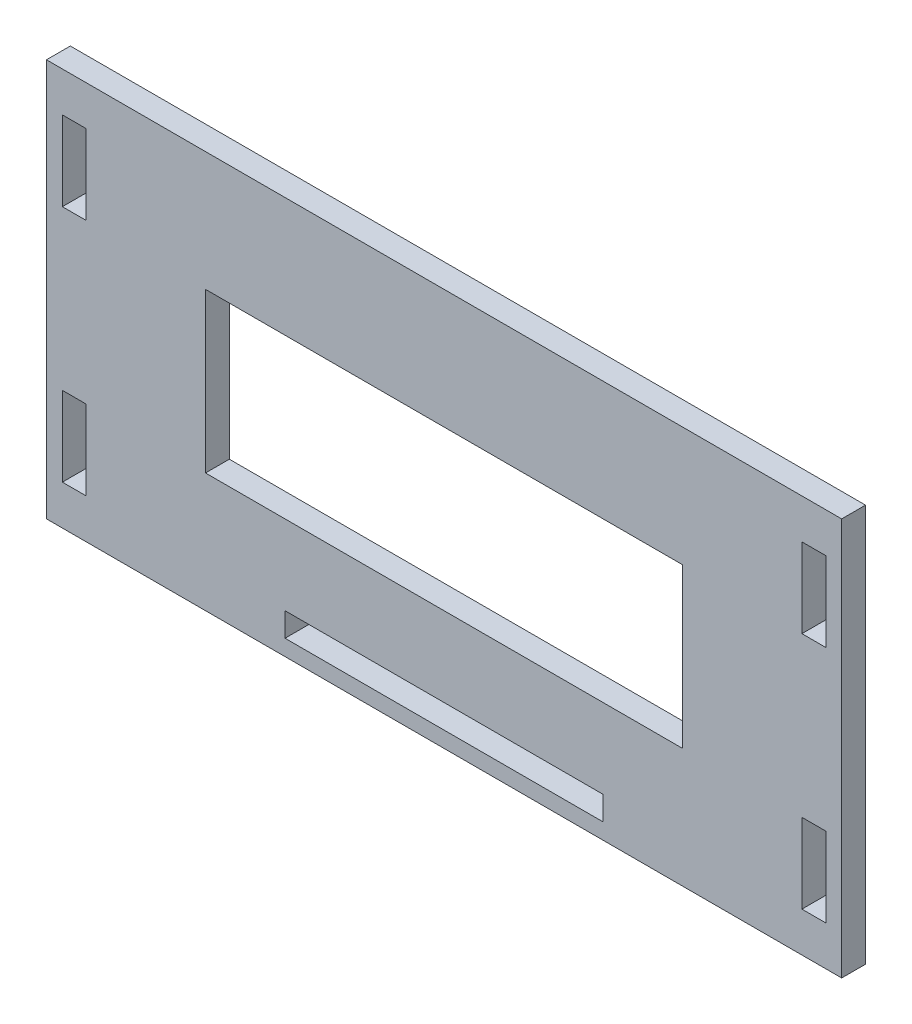
ISO-10303-21;
HEADER;
FILE_DESCRIPTION(('STEP AP214'),'2;1');
FILE_NAME('part.step','',(''),(''),'','','');
FILE_SCHEMA(('AUTOMOTIVE_DESIGN { 1 0 10303 214 1 1 1 1 }'));
ENDSEC;
DATA;
#1=APPLICATION_CONTEXT('core data for automotive mechanical design processes');
#2=APPLICATION_PROTOCOL_DEFINITION('international standard','automotive_design',2000,#1);
#3=PRODUCT_CONTEXT('',#1,'mechanical');
#4=PRODUCT('Part','Part','',(#3));
#5=PRODUCT_RELATED_PRODUCT_CATEGORY('part','',(#4));
#6=PRODUCT_DEFINITION_FORMATION('','',#4);
#7=PRODUCT_DEFINITION_CONTEXT('part definition',#1,'design');
#8=PRODUCT_DEFINITION('design','',#6,#7);
#9=PRODUCT_DEFINITION_SHAPE('','',#8);
#10=(LENGTH_UNIT() NAMED_UNIT(*) SI_UNIT(.MILLI.,.METRE.));
#11=(NAMED_UNIT(*) PLANE_ANGLE_UNIT() SI_UNIT($,.RADIAN.));
#12=(NAMED_UNIT(*) SI_UNIT($,.STERADIAN.) SOLID_ANGLE_UNIT());
#13=UNCERTAINTY_MEASURE_WITH_UNIT(LENGTH_MEASURE(1.E-05),#10,'distance_accuracy_value','');
#14=(GEOMETRIC_REPRESENTATION_CONTEXT(3) GLOBAL_UNCERTAINTY_ASSIGNED_CONTEXT((#13)) GLOBAL_UNIT_ASSIGNED_CONTEXT((#10,
#11,#12)) REPRESENTATION_CONTEXT('',''));
#15=CARTESIAN_POINT('',(0.,0.,0.));
#16=DIRECTION('',(0.,0.,1.));
#17=DIRECTION('',(1.,0.,0.));
#18=AXIS2_PLACEMENT_3D('',#15,#16,#17);
#19=CARTESIAN_POINT('',(0.,0.,3.));
#20=DIRECTION('',(0.,0.,-1.));
#21=DIRECTION('',(-1.,0.,0.));
#22=AXIS2_PLACEMENT_3D('',#19,#20,#21);
#23=PLANE('',#22);
#24=DIRECTION('',(0.,1.,0.));
#25=VECTOR('',#24,1.);
#26=CARTESIAN_POINT('',(48.,-20.,3.));
#27=LINE('',#26,#25);
#28=CARTESIAN_POINT('',(48.,-20.,3.));
#29=VERTEX_POINT('',#28);
#30=CARTESIAN_POINT('',(48.,-10.,3.));
#31=VERTEX_POINT('',#30);
#32=EDGE_CURVE('E253',#29,#31,#27,.T.);
#33=ORIENTED_EDGE('',*,*,#32,.F.);
#34=DIRECTION('',(1.,0.,0.));
#35=VECTOR('',#34,1.);
#36=CARTESIAN_POINT('',(48.,-20.,3.));
#37=LINE('',#36,#35);
#38=CARTESIAN_POINT('',(45.,-20.,3.));
#39=VERTEX_POINT('',#38);
#40=EDGE_CURVE('E261',#39,#29,#37,.T.);
#41=ORIENTED_EDGE('',*,*,#40,.F.);
#42=DIRECTION('',(0.,-1.,0.));
#43=VECTOR('',#42,1.);
#44=CARTESIAN_POINT('',(45.,-20.,3.));
#45=LINE('',#44,#43);
#46=CARTESIAN_POINT('',(45.,-10.,3.));
#47=VERTEX_POINT('',#46);
#48=EDGE_CURVE('E258',#47,#39,#45,.T.);
#49=ORIENTED_EDGE('',*,*,#48,.F.);
#50=DIRECTION('',(-1.,0.,0.));
#51=VECTOR('',#50,1.);
#52=CARTESIAN_POINT('',(48.,-10.,3.));
#53=LINE('',#52,#51);
#54=EDGE_CURVE('E255',#31,#47,#53,.T.);
#55=ORIENTED_EDGE('',*,*,#54,.F.);
#56=EDGE_LOOP('',(#33,#41,#49,#55));
#57=FACE_BOUND('',#56,.T.);
#58=DIRECTION('',(0.,1.,0.));
#59=VECTOR('',#58,1.);
#60=CARTESIAN_POINT('',(48.,20.,3.));
#61=LINE('',#60,#59);
#62=CARTESIAN_POINT('',(48.,10.,3.));
#63=VERTEX_POINT('',#62);
#64=CARTESIAN_POINT('',(48.,20.,3.));
#65=VERTEX_POINT('',#64);
#66=EDGE_CURVE('E315',#63,#65,#61,.T.);
#67=ORIENTED_EDGE('',*,*,#66,.F.);
#68=DIRECTION('',(1.,0.,0.));
#69=VECTOR('',#68,1.);
#70=CARTESIAN_POINT('',(48.,10.,3.));
#71=LINE('',#70,#69);
#72=CARTESIAN_POINT('',(45.,10.,3.));
#73=VERTEX_POINT('',#72);
#74=EDGE_CURVE('E323',#73,#63,#71,.T.);
#75=ORIENTED_EDGE('',*,*,#74,.F.);
#76=DIRECTION('',(0.,-1.,0.));
#77=VECTOR('',#76,1.);
#78=CARTESIAN_POINT('',(45.,20.,3.));
#79=LINE('',#78,#77);
#80=CARTESIAN_POINT('',(45.,20.,3.));
#81=VERTEX_POINT('',#80);
#82=EDGE_CURVE('E320',#81,#73,#79,.T.);
#83=ORIENTED_EDGE('',*,*,#82,.F.);
#84=DIRECTION('',(-1.,0.,0.));
#85=VECTOR('',#84,1.);
#86=CARTESIAN_POINT('',(48.,20.,3.));
#87=LINE('',#86,#85);
#88=EDGE_CURVE('E317',#65,#81,#87,.T.);
#89=ORIENTED_EDGE('',*,*,#88,.F.);
#90=EDGE_LOOP('',(#67,#75,#83,#89));
#91=FACE_BOUND('',#90,.T.);
#92=DIRECTION('',(0.,1.,0.));
#93=VECTOR('',#92,1.);
#94=CARTESIAN_POINT('',(20.,-20.,3.));
#95=LINE('',#94,#93);
#96=CARTESIAN_POINT('',(20.,-23.,3.));
#97=VERTEX_POINT('',#96);
#98=CARTESIAN_POINT('',(20.,-20.,3.));
#99=VERTEX_POINT('',#98);
#100=EDGE_CURVE('E377',#97,#99,#95,.T.);
#101=ORIENTED_EDGE('',*,*,#100,.F.);
#102=DIRECTION('',(1.,0.,0.));
#103=VECTOR('',#102,1.);
#104=CARTESIAN_POINT('',(-20.,-23.,3.));
#105=LINE('',#104,#103);
#106=CARTESIAN_POINT('',(-20.,-23.,3.));
#107=VERTEX_POINT('',#106);
#108=EDGE_CURVE('E385',#107,#97,#105,.T.);
#109=ORIENTED_EDGE('',*,*,#108,.F.);
#110=DIRECTION('',(0.,-1.,0.));
#111=VECTOR('',#110,1.);
#112=CARTESIAN_POINT('',(-20.,-20.,3.));
#113=LINE('',#112,#111);
#114=CARTESIAN_POINT('',(-20.,-20.,3.));
#115=VERTEX_POINT('',#114);
#116=EDGE_CURVE('E382',#115,#107,#113,.T.);
#117=ORIENTED_EDGE('',*,*,#116,.F.);
#118=DIRECTION('',(-1.,0.,0.));
#119=VECTOR('',#118,1.);
#120=CARTESIAN_POINT('',(-20.,-20.,3.));
#121=LINE('',#120,#119);
#122=EDGE_CURVE('E379',#99,#115,#121,.T.);
#123=ORIENTED_EDGE('',*,*,#122,.F.);
#124=EDGE_LOOP('',(#101,#109,#117,#123));
#125=FACE_BOUND('',#124,.T.);
#126=DIRECTION('',(0.,-1.,0.));
#127=VECTOR('',#126,1.);
#128=CARTESIAN_POINT('',(-50.,25.,3.));
#129=LINE('',#128,#127);
#130=CARTESIAN_POINT('',(-50.,25.,3.));
#131=VERTEX_POINT('',#130);
#132=CARTESIAN_POINT('',(-50.,-25.,3.));
#133=VERTEX_POINT('',#132);
#134=EDGE_CURVE('E408',#131,#133,#129,.T.);
#135=ORIENTED_EDGE('',*,*,#134,.T.);
#136=DIRECTION('',(1.,0.,0.));
#137=VECTOR('',#136,1.);
#138=CARTESIAN_POINT('',(50.,-25.,3.));
#139=LINE('',#138,#137);
#140=CARTESIAN_POINT('',(50.,-25.,3.));
#141=VERTEX_POINT('',#140);
#142=EDGE_CURVE('E411',#133,#141,#139,.T.);
#143=ORIENTED_EDGE('',*,*,#142,.T.);
#144=DIRECTION('',(0.,1.,0.));
#145=VECTOR('',#144,1.);
#146=CARTESIAN_POINT('',(50.,25.,3.));
#147=LINE('',#146,#145);
#148=CARTESIAN_POINT('',(50.,25.,3.));
#149=VERTEX_POINT('',#148);
#150=EDGE_CURVE('E414',#141,#149,#147,.T.);
#151=ORIENTED_EDGE('',*,*,#150,.T.);
#152=DIRECTION('',(-1.,0.,0.));
#153=VECTOR('',#152,1.);
#154=CARTESIAN_POINT('',(50.,25.,3.));
#155=LINE('',#154,#153);
#156=EDGE_CURVE('E416',#149,#131,#155,.T.);
#157=ORIENTED_EDGE('',*,*,#156,.T.);
#158=EDGE_LOOP('',(#135,#143,#151,#157));
#159=FACE_BOUND('',#158,.T.);
#160=DIRECTION('',(0.,1.,0.));
#161=VECTOR('',#160,1.);
#162=CARTESIAN_POINT('',(-45.,20.,3.));
#163=LINE('',#162,#161);
#164=CARTESIAN_POINT('',(-45.,10.,3.));
#165=VERTEX_POINT('',#164);
#166=CARTESIAN_POINT('',(-45.,20.,3.));
#167=VERTEX_POINT('',#166);
#168=EDGE_CURVE('E346',#165,#167,#163,.T.);
#169=ORIENTED_EDGE('',*,*,#168,.F.);
#170=DIRECTION('',(1.,0.,0.));
#171=VECTOR('',#170,1.);
#172=CARTESIAN_POINT('',(-48.,10.,3.));
#173=LINE('',#172,#171);
#174=CARTESIAN_POINT('',(-48.,10.,3.));
#175=VERTEX_POINT('',#174);
#176=EDGE_CURVE('E354',#175,#165,#173,.T.);
#177=ORIENTED_EDGE('',*,*,#176,.F.);
#178=DIRECTION('',(0.,-1.,0.));
#179=VECTOR('',#178,1.);
#180=CARTESIAN_POINT('',(-48.,20.,3.));
#181=LINE('',#180,#179);
#182=CARTESIAN_POINT('',(-48.,20.,3.));
#183=VERTEX_POINT('',#182);
#184=EDGE_CURVE('E351',#183,#175,#181,.T.);
#185=ORIENTED_EDGE('',*,*,#184,.F.);
#186=DIRECTION('',(-1.,0.,0.));
#187=VECTOR('',#186,1.);
#188=CARTESIAN_POINT('',(-48.,20.,3.));
#189=LINE('',#188,#187);
#190=EDGE_CURVE('E348',#167,#183,#189,.T.);
#191=ORIENTED_EDGE('',*,*,#190,.F.);
#192=EDGE_LOOP('',(#169,#177,#185,#191));
#193=FACE_BOUND('',#192,.T.);
#194=DIRECTION('',(0.,-1.,0.));
#195=VECTOR('',#194,1.);
#196=CARTESIAN_POINT('',(-30.,10.,3.));
#197=LINE('',#196,#195);
#198=CARTESIAN_POINT('',(-30.,10.,3.));
#199=VERTEX_POINT('',#198);
#200=CARTESIAN_POINT('',(-30.,-9.99999999999999,3.));
#201=VERTEX_POINT('',#200);
#202=EDGE_CURVE('E284',#199,#201,#197,.T.);
#203=ORIENTED_EDGE('',*,*,#202,.F.);
#204=DIRECTION('',(-1.,0.,0.));
#205=VECTOR('',#204,1.);
#206=CARTESIAN_POINT('',(30.,10.,3.));
#207=LINE('',#206,#205);
#208=CARTESIAN_POINT('',(30.,10.,3.));
#209=VERTEX_POINT('',#208);
#210=EDGE_CURVE('E292',#209,#199,#207,.T.);
#211=ORIENTED_EDGE('',*,*,#210,.F.);
#212=DIRECTION('',(0.,1.,0.));
#213=VECTOR('',#212,1.);
#214=CARTESIAN_POINT('',(30.,10.,3.));
#215=LINE('',#214,#213);
#216=CARTESIAN_POINT('',(30.,-9.99999999999998,3.));
#217=VERTEX_POINT('',#216);
#218=EDGE_CURVE('E289',#217,#209,#215,.T.);
#219=ORIENTED_EDGE('',*,*,#218,.F.);
#220=DIRECTION('',(1.,0.,0.));
#221=VECTOR('',#220,1.);
#222=CARTESIAN_POINT('',(30.,-9.99999999999998,3.));
#223=LINE('',#222,#221);
#224=EDGE_CURVE('E286',#201,#217,#223,.T.);
#225=ORIENTED_EDGE('',*,*,#224,.F.);
#226=EDGE_LOOP('',(#203,#211,#219,#225));
#227=FACE_BOUND('',#226,.T.);
#228=DIRECTION('',(0.,-1.,0.));
#229=VECTOR('',#228,1.);
#230=CARTESIAN_POINT('',(-48.,-20.,3.));
#231=LINE('',#230,#229);
#232=CARTESIAN_POINT('',(-48.,-10.,3.));
#233=VERTEX_POINT('',#232);
#234=CARTESIAN_POINT('',(-48.,-20.,3.));
#235=VERTEX_POINT('',#234);
#236=EDGE_CURVE('E217',#233,#235,#231,.T.);
#237=ORIENTED_EDGE('',*,*,#236,.F.);
#238=DIRECTION('',(-1.,0.,0.));
#239=VECTOR('',#238,1.);
#240=CARTESIAN_POINT('',(-48.,-10.,3.));
#241=LINE('',#240,#239);
#242=CARTESIAN_POINT('',(-45.,-10.,3.));
#243=VERTEX_POINT('',#242);
#244=EDGE_CURVE('E239',#243,#233,#241,.T.);
#245=ORIENTED_EDGE('',*,*,#244,.F.);
#246=DIRECTION('',(0.,1.,0.));
#247=VECTOR('',#246,1.);
#248=CARTESIAN_POINT('',(-45.,-20.,3.));
#249=LINE('',#248,#247);
#250=CARTESIAN_POINT('',(-45.,-20.,3.));
#251=VERTEX_POINT('',#250);
#252=EDGE_CURVE('E237',#251,#243,#249,.T.);
#253=ORIENTED_EDGE('',*,*,#252,.F.);
#254=DIRECTION('',(1.,0.,0.));
#255=VECTOR('',#254,1.);
#256=CARTESIAN_POINT('',(-48.,-20.,3.));
#257=LINE('',#256,#255);
#258=EDGE_CURVE('E225',#235,#251,#257,.T.);
#259=ORIENTED_EDGE('',*,*,#258,.F.);
#260=EDGE_LOOP('',(#237,#245,#253,#259));
#261=FACE_BOUND('',#260,.T.);
#262=ADVANCED_FACE('F32',(#57,#91,#125,#159,#193,#227,#261),#23,.F.);
#263=CARTESIAN_POINT('',(0.,0.,0.));
#264=DIRECTION('',(0.,0.,-1.));
#265=DIRECTION('',(-1.,0.,0.));
#266=AXIS2_PLACEMENT_3D('',#263,#264,#265);
#267=PLANE('',#266);
#268=DIRECTION('',(0.,-1.,0.));
#269=VECTOR('',#268,1.);
#270=CARTESIAN_POINT('',(-50.,25.,0.));
#271=LINE('',#270,#269);
#272=CARTESIAN_POINT('',(-50.,25.,0.));
#273=VERTEX_POINT('',#272);
#274=CARTESIAN_POINT('',(-50.,-25.,0.));
#275=VERTEX_POINT('',#274);
#276=EDGE_CURVE('E407',#273,#275,#271,.T.);
#277=ORIENTED_EDGE('',*,*,#276,.F.);
#278=DIRECTION('',(-1.,0.,0.));
#279=VECTOR('',#278,1.);
#280=CARTESIAN_POINT('',(50.,25.,0.));
#281=LINE('',#280,#279);
#282=CARTESIAN_POINT('',(50.,25.,0.));
#283=VERTEX_POINT('',#282);
#284=EDGE_CURVE('E412',#283,#273,#281,.T.);
#285=ORIENTED_EDGE('',*,*,#284,.F.);
#286=DIRECTION('',(0.,1.,0.));
#287=VECTOR('',#286,1.);
#288=CARTESIAN_POINT('',(50.,25.,0.));
#289=LINE('',#288,#287);
#290=CARTESIAN_POINT('',(50.,-25.,0.));
#291=VERTEX_POINT('',#290);
#292=EDGE_CURVE('E423',#291,#283,#289,.T.);
#293=ORIENTED_EDGE('',*,*,#292,.F.);
#294=DIRECTION('',(1.,0.,0.));
#295=VECTOR('',#294,1.);
#296=CARTESIAN_POINT('',(50.,-25.,0.));
#297=LINE('',#296,#295);
#298=EDGE_CURVE('E421',#275,#291,#297,.T.);
#299=ORIENTED_EDGE('',*,*,#298,.F.);
#300=EDGE_LOOP('',(#277,#285,#293,#299));
#301=FACE_BOUND('',#300,.T.);
#302=DIRECTION('',(1.,0.,0.));
#303=VECTOR('',#302,1.);
#304=CARTESIAN_POINT('',(-20.,-23.,0.));
#305=LINE('',#304,#303);
#306=CARTESIAN_POINT('',(-20.,-23.,0.));
#307=VERTEX_POINT('',#306);
#308=CARTESIAN_POINT('',(20.,-23.,0.));
#309=VERTEX_POINT('',#308);
#310=EDGE_CURVE('E380',#307,#309,#305,.T.);
#311=ORIENTED_EDGE('',*,*,#310,.T.);
#312=DIRECTION('',(0.,1.,0.));
#313=VECTOR('',#312,1.);
#314=CARTESIAN_POINT('',(20.,-20.,0.));
#315=LINE('',#314,#313);
#316=CARTESIAN_POINT('',(20.,-20.,0.));
#317=VERTEX_POINT('',#316);
#318=EDGE_CURVE('E376',#309,#317,#315,.T.);
#319=ORIENTED_EDGE('',*,*,#318,.T.);
#320=DIRECTION('',(-1.,0.,0.));
#321=VECTOR('',#320,1.);
#322=CARTESIAN_POINT('',(-20.,-20.,0.));
#323=LINE('',#322,#321);
#324=CARTESIAN_POINT('',(-20.,-20.,0.));
#325=VERTEX_POINT('',#324);
#326=EDGE_CURVE('E390',#317,#325,#323,.T.);
#327=ORIENTED_EDGE('',*,*,#326,.T.);
#328=DIRECTION('',(0.,-1.,0.));
#329=VECTOR('',#328,1.);
#330=CARTESIAN_POINT('',(-20.,-20.,0.));
#331=LINE('',#330,#329);
#332=EDGE_CURVE('E393',#325,#307,#331,.T.);
#333=ORIENTED_EDGE('',*,*,#332,.T.);
#334=EDGE_LOOP('',(#311,#319,#327,#333));
#335=FACE_BOUND('',#334,.T.);
#336=DIRECTION('',(1.,0.,0.));
#337=VECTOR('',#336,1.);
#338=CARTESIAN_POINT('',(-48.,10.,0.));
#339=LINE('',#338,#337);
#340=CARTESIAN_POINT('',(-48.,10.,0.));
#341=VERTEX_POINT('',#340);
#342=CARTESIAN_POINT('',(-45.,10.,0.));
#343=VERTEX_POINT('',#342);
#344=EDGE_CURVE('E349',#341,#343,#339,.T.);
#345=ORIENTED_EDGE('',*,*,#344,.T.);
#346=DIRECTION('',(0.,1.,0.));
#347=VECTOR('',#346,1.);
#348=CARTESIAN_POINT('',(-45.,20.,0.));
#349=LINE('',#348,#347);
#350=CARTESIAN_POINT('',(-45.,20.,0.));
#351=VERTEX_POINT('',#350);
#352=EDGE_CURVE('E345',#343,#351,#349,.T.);
#353=ORIENTED_EDGE('',*,*,#352,.T.);
#354=DIRECTION('',(-1.,0.,0.));
#355=VECTOR('',#354,1.);
#356=CARTESIAN_POINT('',(-48.,20.,0.));
#357=LINE('',#356,#355);
#358=CARTESIAN_POINT('',(-48.,20.,0.));
#359=VERTEX_POINT('',#358);
#360=EDGE_CURVE('E359',#351,#359,#357,.T.);
#361=ORIENTED_EDGE('',*,*,#360,.T.);
#362=DIRECTION('',(0.,-1.,0.));
#363=VECTOR('',#362,1.);
#364=CARTESIAN_POINT('',(-48.,20.,0.));
#365=LINE('',#364,#363);
#366=EDGE_CURVE('E362',#359,#341,#365,.T.);
#367=ORIENTED_EDGE('',*,*,#366,.T.);
#368=EDGE_LOOP('',(#345,#353,#361,#367));
#369=FACE_BOUND('',#368,.T.);
#370=DIRECTION('',(1.,0.,0.));
#371=VECTOR('',#370,1.);
#372=CARTESIAN_POINT('',(48.,10.,0.));
#373=LINE('',#372,#371);
#374=CARTESIAN_POINT('',(45.,10.,0.));
#375=VERTEX_POINT('',#374);
#376=CARTESIAN_POINT('',(48.,10.,0.));
#377=VERTEX_POINT('',#376);
#378=EDGE_CURVE('E318',#375,#377,#373,.T.);
#379=ORIENTED_EDGE('',*,*,#378,.T.);
#380=DIRECTION('',(0.,1.,0.));
#381=VECTOR('',#380,1.);
#382=CARTESIAN_POINT('',(48.,20.,0.));
#383=LINE('',#382,#381);
#384=CARTESIAN_POINT('',(48.,20.,0.));
#385=VERTEX_POINT('',#384);
#386=EDGE_CURVE('E314',#377,#385,#383,.T.);
#387=ORIENTED_EDGE('',*,*,#386,.T.);
#388=DIRECTION('',(-1.,0.,0.));
#389=VECTOR('',#388,1.);
#390=CARTESIAN_POINT('',(48.,20.,0.));
#391=LINE('',#390,#389);
#392=CARTESIAN_POINT('',(45.,20.,0.));
#393=VERTEX_POINT('',#392);
#394=EDGE_CURVE('E328',#385,#393,#391,.T.);
#395=ORIENTED_EDGE('',*,*,#394,.T.);
#396=DIRECTION('',(0.,-1.,0.));
#397=VECTOR('',#396,1.);
#398=CARTESIAN_POINT('',(45.,20.,0.));
#399=LINE('',#398,#397);
#400=EDGE_CURVE('E331',#393,#375,#399,.T.);
#401=ORIENTED_EDGE('',*,*,#400,.T.);
#402=EDGE_LOOP('',(#379,#387,#395,#401));
#403=FACE_BOUND('',#402,.T.);
#404=DIRECTION('',(-1.,0.,0.));
#405=VECTOR('',#404,1.);
#406=CARTESIAN_POINT('',(30.,10.,0.));
#407=LINE('',#406,#405);
#408=CARTESIAN_POINT('',(30.,10.,0.));
#409=VERTEX_POINT('',#408);
#410=CARTESIAN_POINT('',(-30.,10.,0.));
#411=VERTEX_POINT('',#410);
#412=EDGE_CURVE('E287',#409,#411,#407,.T.);
#413=ORIENTED_EDGE('',*,*,#412,.T.);
#414=DIRECTION('',(0.,-1.,0.));
#415=VECTOR('',#414,1.);
#416=CARTESIAN_POINT('',(-30.,10.,0.));
#417=LINE('',#416,#415);
#418=CARTESIAN_POINT('',(-30.,-9.99999999999999,0.));
#419=VERTEX_POINT('',#418);
#420=EDGE_CURVE('E283',#411,#419,#417,.T.);
#421=ORIENTED_EDGE('',*,*,#420,.T.);
#422=DIRECTION('',(1.,0.,0.));
#423=VECTOR('',#422,1.);
#424=CARTESIAN_POINT('',(30.,-9.99999999999998,0.));
#425=LINE('',#424,#423);
#426=CARTESIAN_POINT('',(30.,-9.99999999999998,0.));
#427=VERTEX_POINT('',#426);
#428=EDGE_CURVE('E297',#419,#427,#425,.T.);
#429=ORIENTED_EDGE('',*,*,#428,.T.);
#430=DIRECTION('',(0.,1.,0.));
#431=VECTOR('',#430,1.);
#432=CARTESIAN_POINT('',(30.,10.,0.));
#433=LINE('',#432,#431);
#434=EDGE_CURVE('E300',#427,#409,#433,.T.);
#435=ORIENTED_EDGE('',*,*,#434,.T.);
#436=EDGE_LOOP('',(#413,#421,#429,#435));
#437=FACE_BOUND('',#436,.T.);
#438=DIRECTION('',(1.,0.,0.));
#439=VECTOR('',#438,1.);
#440=CARTESIAN_POINT('',(48.,-20.,0.));
#441=LINE('',#440,#439);
#442=CARTESIAN_POINT('',(45.,-20.,0.));
#443=VERTEX_POINT('',#442);
#444=CARTESIAN_POINT('',(48.,-20.,0.));
#445=VERTEX_POINT('',#444);
#446=EDGE_CURVE('E256',#443,#445,#441,.T.);
#447=ORIENTED_EDGE('',*,*,#446,.T.);
#448=DIRECTION('',(0.,1.,0.));
#449=VECTOR('',#448,1.);
#450=CARTESIAN_POINT('',(48.,-20.,0.));
#451=LINE('',#450,#449);
#452=CARTESIAN_POINT('',(48.,-10.,0.));
#453=VERTEX_POINT('',#452);
#454=EDGE_CURVE('E233',#445,#453,#451,.T.);
#455=ORIENTED_EDGE('',*,*,#454,.T.);
#456=DIRECTION('',(-1.,0.,0.));
#457=VECTOR('',#456,1.);
#458=CARTESIAN_POINT('',(48.,-10.,0.));
#459=LINE('',#458,#457);
#460=CARTESIAN_POINT('',(45.,-10.,0.));
#461=VERTEX_POINT('',#460);
#462=EDGE_CURVE('E266',#453,#461,#459,.T.);
#463=ORIENTED_EDGE('',*,*,#462,.T.);
#464=DIRECTION('',(0.,-1.,0.));
#465=VECTOR('',#464,1.);
#466=CARTESIAN_POINT('',(45.,-20.,0.));
#467=LINE('',#466,#465);
#468=EDGE_CURVE('E269',#461,#443,#467,.T.);
#469=ORIENTED_EDGE('',*,*,#468,.T.);
#470=EDGE_LOOP('',(#447,#455,#463,#469));
#471=FACE_BOUND('',#470,.T.);
#472=DIRECTION('',(-1.,0.,0.));
#473=VECTOR('',#472,1.);
#474=CARTESIAN_POINT('',(-48.,-10.,0.));
#475=LINE('',#474,#473);
#476=CARTESIAN_POINT('',(-45.,-10.,0.));
#477=VERTEX_POINT('',#476);
#478=CARTESIAN_POINT('',(-48.,-10.,0.));
#479=VERTEX_POINT('',#478);
#480=EDGE_CURVE('E226',#477,#479,#475,.T.);
#481=ORIENTED_EDGE('',*,*,#480,.T.);
#482=DIRECTION('',(0.,-1.,0.));
#483=VECTOR('',#482,1.);
#484=CARTESIAN_POINT('',(-48.,-20.,0.));
#485=LINE('',#484,#483);
#486=CARTESIAN_POINT('',(-48.,-20.,0.));
#487=VERTEX_POINT('',#486);
#488=EDGE_CURVE('E55',#479,#487,#485,.T.);
#489=ORIENTED_EDGE('',*,*,#488,.T.);
#490=DIRECTION('',(1.,0.,0.));
#491=VECTOR('',#490,1.);
#492=CARTESIAN_POINT('',(-48.,-20.,0.));
#493=LINE('',#492,#491);
#494=CARTESIAN_POINT('',(-45.,-20.,0.));
#495=VERTEX_POINT('',#494);
#496=EDGE_CURVE('E232',#487,#495,#493,.T.);
#497=ORIENTED_EDGE('',*,*,#496,.T.);
#498=DIRECTION('',(0.,1.,0.));
#499=VECTOR('',#498,1.);
#500=CARTESIAN_POINT('',(-45.,-20.,0.));
#501=LINE('',#500,#499);
#502=EDGE_CURVE('E245',#495,#477,#501,.T.);
#503=ORIENTED_EDGE('',*,*,#502,.T.);
#504=EDGE_LOOP('',(#481,#489,#497,#503));
#505=FACE_BOUND('',#504,.T.);
#506=ADVANCED_FACE('F441',(#301,#335,#369,#403,#437,#471,#505),#267,.T.);
#507=CARTESIAN_POINT('',(-50.,25.,3.));
#508=DIRECTION('',(1.,0.,0.));
#509=DIRECTION('',(0.,1.,0.));
#510=AXIS2_PLACEMENT_3D('',#507,#508,#509);
#511=PLANE('',#510);
#512=ORIENTED_EDGE('',*,*,#276,.T.);
#513=DIRECTION('',(0.,0.,-1.));
#514=VECTOR('',#513,1.);
#515=CARTESIAN_POINT('',(-50.,-25.,3.));
#516=LINE('',#515,#514);
#517=EDGE_CURVE('E11',#133,#275,#516,.T.);
#518=ORIENTED_EDGE('',*,*,#517,.F.);
#519=ORIENTED_EDGE('',*,*,#134,.F.);
#520=DIRECTION('',(0.,0.,-1.));
#521=VECTOR('',#520,1.);
#522=CARTESIAN_POINT('',(-50.,25.,3.));
#523=LINE('',#522,#521);
#524=EDGE_CURVE('E418',#131,#273,#523,.T.);
#525=ORIENTED_EDGE('',*,*,#524,.T.);
#526=EDGE_LOOP('',(#512,#518,#519,#525));
#527=FACE_BOUND('',#526,.T.);
#528=ADVANCED_FACE('F34',(#527),#511,.F.);
#529=CARTESIAN_POINT('',(50.,-25.,3.));
#530=DIRECTION('',(0.,1.,0.));
#531=DIRECTION('',(-1.,0.,0.));
#532=AXIS2_PLACEMENT_3D('',#529,#530,#531);
#533=PLANE('',#532);
#534=ORIENTED_EDGE('',*,*,#298,.T.);
#535=DIRECTION('',(0.,0.,-1.));
#536=VECTOR('',#535,1.);
#537=CARTESIAN_POINT('',(50.,-25.,3.));
#538=LINE('',#537,#536);
#539=EDGE_CURVE('E40',#141,#291,#538,.T.);
#540=ORIENTED_EDGE('',*,*,#539,.F.);
#541=ORIENTED_EDGE('',*,*,#142,.F.);
#542=ORIENTED_EDGE('',*,*,#517,.T.);
#543=EDGE_LOOP('',(#534,#540,#541,#542));
#544=FACE_BOUND('',#543,.T.);
#545=ADVANCED_FACE('F452',(#544),#533,.F.);
#546=CARTESIAN_POINT('',(50.,25.,3.));
#547=DIRECTION('',(-1.,0.,0.));
#548=DIRECTION('',(0.,-1.,0.));
#549=AXIS2_PLACEMENT_3D('',#546,#547,#548);
#550=PLANE('',#549);
#551=ORIENTED_EDGE('',*,*,#292,.T.);
#552=DIRECTION('',(0.,0.,-1.));
#553=VECTOR('',#552,1.);
#554=CARTESIAN_POINT('',(50.,25.,3.));
#555=LINE('',#554,#553);
#556=EDGE_CURVE('E428',#149,#283,#555,.T.);
#557=ORIENTED_EDGE('',*,*,#556,.F.);
#558=ORIENTED_EDGE('',*,*,#150,.F.);
#559=ORIENTED_EDGE('',*,*,#539,.T.);
#560=EDGE_LOOP('',(#551,#557,#558,#559));
#561=FACE_BOUND('',#560,.T.);
#562=ADVANCED_FACE('F435',(#561),#550,.F.);
#563=CARTESIAN_POINT('',(50.,25.,3.));
#564=DIRECTION('',(0.,-1.,0.));
#565=DIRECTION('',(1.,0.,0.));
#566=AXIS2_PLACEMENT_3D('',#563,#564,#565);
#567=PLANE('',#566);
#568=ORIENTED_EDGE('',*,*,#284,.T.);
#569=ORIENTED_EDGE('',*,*,#524,.F.);
#570=ORIENTED_EDGE('',*,*,#156,.F.);
#571=ORIENTED_EDGE('',*,*,#556,.T.);
#572=EDGE_LOOP('',(#568,#569,#570,#571));
#573=FACE_BOUND('',#572,.T.);
#574=ADVANCED_FACE('F445',(#573),#567,.F.);
#575=CARTESIAN_POINT('',(20.,-20.,3.));
#576=DIRECTION('',(-1.,0.,0.));
#577=DIRECTION('',(0.,0.,1.));
#578=AXIS2_PLACEMENT_3D('',#575,#576,#577);
#579=PLANE('',#578);
#580=ORIENTED_EDGE('',*,*,#318,.F.);
#581=DIRECTION('',(0.,0.,-1.));
#582=VECTOR('',#581,1.);
#583=CARTESIAN_POINT('',(20.,-23.,3.));
#584=LINE('',#583,#582);
#585=EDGE_CURVE('E387',#97,#309,#584,.T.);
#586=ORIENTED_EDGE('',*,*,#585,.F.);
#587=ORIENTED_EDGE('',*,*,#100,.T.);
#588=DIRECTION('',(0.,0.,-1.));
#589=VECTOR('',#588,1.);
#590=CARTESIAN_POINT('',(20.,-20.,3.));
#591=LINE('',#590,#589);
#592=EDGE_CURVE('E404',#99,#317,#591,.T.);
#593=ORIENTED_EDGE('',*,*,#592,.T.);
#594=EDGE_LOOP('',(#580,#586,#587,#593));
#595=FACE_BOUND('',#594,.T.);
#596=ADVANCED_FACE('F469',(#595),#579,.T.);
#597=CARTESIAN_POINT('',(-20.,-20.,3.));
#598=DIRECTION('',(0.,-1.,0.));
#599=DIRECTION('',(0.,0.,-1.));
#600=AXIS2_PLACEMENT_3D('',#597,#598,#599);
#601=PLANE('',#600);
#602=ORIENTED_EDGE('',*,*,#326,.F.);
#603=ORIENTED_EDGE('',*,*,#592,.F.);
#604=ORIENTED_EDGE('',*,*,#122,.T.);
#605=DIRECTION('',(0.,0.,-1.));
#606=VECTOR('',#605,1.);
#607=CARTESIAN_POINT('',(-20.,-20.,3.));
#608=LINE('',#607,#606);
#609=EDGE_CURVE('E402',#115,#325,#608,.T.);
#610=ORIENTED_EDGE('',*,*,#609,.T.);
#611=EDGE_LOOP('',(#602,#603,#604,#610));
#612=FACE_BOUND('',#611,.T.);
#613=ADVANCED_FACE('F476',(#612),#601,.T.);
#614=CARTESIAN_POINT('',(-20.,-20.,3.));
#615=DIRECTION('',(1.,0.,0.));
#616=DIRECTION('',(0.,0.,-1.));
#617=AXIS2_PLACEMENT_3D('',#614,#615,#616);
#618=PLANE('',#617);
#619=ORIENTED_EDGE('',*,*,#332,.F.);
#620=ORIENTED_EDGE('',*,*,#609,.F.);
#621=ORIENTED_EDGE('',*,*,#116,.T.);
#622=DIRECTION('',(0.,0.,-1.));
#623=VECTOR('',#622,1.);
#624=CARTESIAN_POINT('',(-20.,-23.,3.));
#625=LINE('',#624,#623);
#626=EDGE_CURVE('E400',#107,#307,#625,.T.);
#627=ORIENTED_EDGE('',*,*,#626,.T.);
#628=EDGE_LOOP('',(#619,#620,#621,#627));
#629=FACE_BOUND('',#628,.T.);
#630=ADVANCED_FACE('F481',(#629),#618,.T.);
#631=CARTESIAN_POINT('',(-20.,-23.,3.));
#632=DIRECTION('',(0.,1.,0.));
#633=DIRECTION('',(0.,0.,1.));
#634=AXIS2_PLACEMENT_3D('',#631,#632,#633);
#635=PLANE('',#634);
#636=ORIENTED_EDGE('',*,*,#310,.F.);
#637=ORIENTED_EDGE('',*,*,#626,.F.);
#638=ORIENTED_EDGE('',*,*,#108,.T.);
#639=ORIENTED_EDGE('',*,*,#585,.T.);
#640=EDGE_LOOP('',(#636,#637,#638,#639));
#641=FACE_BOUND('',#640,.T.);
#642=ADVANCED_FACE('F488',(#641),#635,.T.);
#643=CARTESIAN_POINT('',(-45.,20.,3.));
#644=DIRECTION('',(-1.,0.,0.));
#645=DIRECTION('',(0.,0.,1.));
#646=AXIS2_PLACEMENT_3D('',#643,#644,#645);
#647=PLANE('',#646);
#648=ORIENTED_EDGE('',*,*,#352,.F.);
#649=DIRECTION('',(0.,0.,-1.));
#650=VECTOR('',#649,1.);
#651=CARTESIAN_POINT('',(-45.,10.,3.));
#652=LINE('',#651,#650);
#653=EDGE_CURVE('E356',#165,#343,#652,.T.);
#654=ORIENTED_EDGE('',*,*,#653,.F.);
#655=ORIENTED_EDGE('',*,*,#168,.T.);
#656=DIRECTION('',(0.,0.,-1.));
#657=VECTOR('',#656,1.);
#658=CARTESIAN_POINT('',(-45.,20.,3.));
#659=LINE('',#658,#657);
#660=EDGE_CURVE('E373',#167,#351,#659,.T.);
#661=ORIENTED_EDGE('',*,*,#660,.T.);
#662=EDGE_LOOP('',(#648,#654,#655,#661));
#663=FACE_BOUND('',#662,.T.);
#664=ADVANCED_FACE('F502',(#663),#647,.T.);
#665=CARTESIAN_POINT('',(-48.,20.,3.));
#666=DIRECTION('',(0.,-1.,0.));
#667=DIRECTION('',(0.,0.,-1.));
#668=AXIS2_PLACEMENT_3D('',#665,#666,#667);
#669=PLANE('',#668);
#670=ORIENTED_EDGE('',*,*,#360,.F.);
#671=ORIENTED_EDGE('',*,*,#660,.F.);
#672=ORIENTED_EDGE('',*,*,#190,.T.);
#673=DIRECTION('',(0.,0.,-1.));
#674=VECTOR('',#673,1.);
#675=CARTESIAN_POINT('',(-48.,20.,3.));
#676=LINE('',#675,#674);
#677=EDGE_CURVE('E371',#183,#359,#676,.T.);
#678=ORIENTED_EDGE('',*,*,#677,.T.);
#679=EDGE_LOOP('',(#670,#671,#672,#678));
#680=FACE_BOUND('',#679,.T.);
#681=ADVANCED_FACE('F507',(#680),#669,.T.);
#682=CARTESIAN_POINT('',(-48.,20.,3.));
#683=DIRECTION('',(1.,0.,0.));
#684=DIRECTION('',(0.,0.,-1.));
#685=AXIS2_PLACEMENT_3D('',#682,#683,#684);
#686=PLANE('',#685);
#687=ORIENTED_EDGE('',*,*,#366,.F.);
#688=ORIENTED_EDGE('',*,*,#677,.F.);
#689=ORIENTED_EDGE('',*,*,#184,.T.);
#690=DIRECTION('',(0.,0.,-1.));
#691=VECTOR('',#690,1.);
#692=CARTESIAN_POINT('',(-48.,10.,3.));
#693=LINE('',#692,#691);
#694=EDGE_CURVE('E369',#175,#341,#693,.T.);
#695=ORIENTED_EDGE('',*,*,#694,.T.);
#696=EDGE_LOOP('',(#687,#688,#689,#695));
#697=FACE_BOUND('',#696,.T.);
#698=ADVANCED_FACE('F511',(#697),#686,.T.);
#699=CARTESIAN_POINT('',(-48.,10.,3.));
#700=DIRECTION('',(0.,1.,0.));
#701=DIRECTION('',(0.,0.,1.));
#702=AXIS2_PLACEMENT_3D('',#699,#700,#701);
#703=PLANE('',#702);
#704=ORIENTED_EDGE('',*,*,#344,.F.);
#705=ORIENTED_EDGE('',*,*,#694,.F.);
#706=ORIENTED_EDGE('',*,*,#176,.T.);
#707=ORIENTED_EDGE('',*,*,#653,.T.);
#708=EDGE_LOOP('',(#704,#705,#706,#707));
#709=FACE_BOUND('',#708,.T.);
#710=ADVANCED_FACE('F515',(#709),#703,.T.);
#711=CARTESIAN_POINT('',(48.,20.,3.));
#712=DIRECTION('',(-1.,0.,0.));
#713=DIRECTION('',(0.,-1.,0.));
#714=AXIS2_PLACEMENT_3D('',#711,#712,#713);
#715=PLANE('',#714);
#716=ORIENTED_EDGE('',*,*,#386,.F.);
#717=DIRECTION('',(0.,0.,-1.));
#718=VECTOR('',#717,1.);
#719=CARTESIAN_POINT('',(48.,10.,3.));
#720=LINE('',#719,#718);
#721=EDGE_CURVE('E325',#63,#377,#720,.T.);
#722=ORIENTED_EDGE('',*,*,#721,.F.);
#723=ORIENTED_EDGE('',*,*,#66,.T.);
#724=DIRECTION('',(0.,0.,-1.));
#725=VECTOR('',#724,1.);
#726=CARTESIAN_POINT('',(48.,20.,3.));
#727=LINE('',#726,#725);
#728=EDGE_CURVE('E342',#65,#385,#727,.T.);
#729=ORIENTED_EDGE('',*,*,#728,.T.);
#730=EDGE_LOOP('',(#716,#722,#723,#729));
#731=FACE_BOUND('',#730,.T.);
#732=ADVANCED_FACE('F519',(#731),#715,.T.);
#733=CARTESIAN_POINT('',(48.,20.,3.));
#734=DIRECTION('',(0.,-1.,0.));
#735=DIRECTION('',(0.,0.,-1.));
#736=AXIS2_PLACEMENT_3D('',#733,#734,#735);
#737=PLANE('',#736);
#738=ORIENTED_EDGE('',*,*,#394,.F.);
#739=ORIENTED_EDGE('',*,*,#728,.F.);
#740=ORIENTED_EDGE('',*,*,#88,.T.);
#741=DIRECTION('',(0.,0.,-1.));
#742=VECTOR('',#741,1.);
#743=CARTESIAN_POINT('',(45.,20.,3.));
#744=LINE('',#743,#742);
#745=EDGE_CURVE('E340',#81,#393,#744,.T.);
#746=ORIENTED_EDGE('',*,*,#745,.T.);
#747=EDGE_LOOP('',(#738,#739,#740,#746));
#748=FACE_BOUND('',#747,.T.);
#749=ADVANCED_FACE('F523',(#748),#737,.T.);
#750=CARTESIAN_POINT('',(45.,20.,3.));
#751=DIRECTION('',(1.,0.,0.));
#752=DIRECTION('',(0.,1.,0.));
#753=AXIS2_PLACEMENT_3D('',#750,#751,#752);
#754=PLANE('',#753);
#755=ORIENTED_EDGE('',*,*,#400,.F.);
#756=ORIENTED_EDGE('',*,*,#745,.F.);
#757=ORIENTED_EDGE('',*,*,#82,.T.);
#758=DIRECTION('',(0.,0.,-1.));
#759=VECTOR('',#758,1.);
#760=CARTESIAN_POINT('',(45.,10.,3.));
#761=LINE('',#760,#759);
#762=EDGE_CURVE('E338',#73,#375,#761,.T.);
#763=ORIENTED_EDGE('',*,*,#762,.T.);
#764=EDGE_LOOP('',(#755,#756,#757,#763));
#765=FACE_BOUND('',#764,.T.);
#766=ADVANCED_FACE('F527',(#765),#754,.T.);
#767=CARTESIAN_POINT('',(48.,10.,3.));
#768=DIRECTION('',(0.,1.,0.));
#769=DIRECTION('',(-1.,0.,0.));
#770=AXIS2_PLACEMENT_3D('',#767,#768,#769);
#771=PLANE('',#770);
#772=ORIENTED_EDGE('',*,*,#378,.F.);
#773=ORIENTED_EDGE('',*,*,#762,.F.);
#774=ORIENTED_EDGE('',*,*,#74,.T.);
#775=ORIENTED_EDGE('',*,*,#721,.T.);
#776=EDGE_LOOP('',(#772,#773,#774,#775));
#777=FACE_BOUND('',#776,.T.);
#778=ADVANCED_FACE('F531',(#777),#771,.T.);
#779=CARTESIAN_POINT('',(-30.,10.,3.));
#780=DIRECTION('',(1.,0.,0.));
#781=DIRECTION('',(0.,1.,0.));
#782=AXIS2_PLACEMENT_3D('',#779,#780,#781);
#783=PLANE('',#782);
#784=ORIENTED_EDGE('',*,*,#420,.F.);
#785=DIRECTION('',(0.,0.,-1.));
#786=VECTOR('',#785,1.);
#787=CARTESIAN_POINT('',(-30.,10.,3.));
#788=LINE('',#787,#786);
#789=EDGE_CURVE('E294',#199,#411,#788,.T.);
#790=ORIENTED_EDGE('',*,*,#789,.F.);
#791=ORIENTED_EDGE('',*,*,#202,.T.);
#792=DIRECTION('',(0.,0.,-1.));
#793=VECTOR('',#792,1.);
#794=CARTESIAN_POINT('',(-30.,-9.99999999999999,3.));
#795=LINE('',#794,#793);
#796=EDGE_CURVE('E311',#201,#419,#795,.T.);
#797=ORIENTED_EDGE('',*,*,#796,.T.);
#798=EDGE_LOOP('',(#784,#790,#791,#797));
#799=FACE_BOUND('',#798,.T.);
#800=ADVANCED_FACE('F535',(#799),#783,.T.);
#801=CARTESIAN_POINT('',(30.,-9.99999999999998,3.));
#802=DIRECTION('',(0.,1.,0.));
#803=DIRECTION('',(-1.,0.,0.));
#804=AXIS2_PLACEMENT_3D('',#801,#802,#803);
#805=PLANE('',#804);
#806=ORIENTED_EDGE('',*,*,#428,.F.);
#807=ORIENTED_EDGE('',*,*,#796,.F.);
#808=ORIENTED_EDGE('',*,*,#224,.T.);
#809=DIRECTION('',(0.,0.,-1.));
#810=VECTOR('',#809,1.);
#811=CARTESIAN_POINT('',(30.,-9.99999999999998,3.));
#812=LINE('',#811,#810);
#813=EDGE_CURVE('E309',#217,#427,#812,.T.);
#814=ORIENTED_EDGE('',*,*,#813,.T.);
#815=EDGE_LOOP('',(#806,#807,#808,#814));
#816=FACE_BOUND('',#815,.T.);
#817=ADVANCED_FACE('F539',(#816),#805,.T.);
#818=CARTESIAN_POINT('',(30.,10.,3.));
#819=DIRECTION('',(-1.,0.,0.));
#820=DIRECTION('',(0.,-1.,0.));
#821=AXIS2_PLACEMENT_3D('',#818,#819,#820);
#822=PLANE('',#821);
#823=ORIENTED_EDGE('',*,*,#434,.F.);
#824=ORIENTED_EDGE('',*,*,#813,.F.);
#825=ORIENTED_EDGE('',*,*,#218,.T.);
#826=DIRECTION('',(0.,0.,-1.));
#827=VECTOR('',#826,1.);
#828=CARTESIAN_POINT('',(30.,10.,3.));
#829=LINE('',#828,#827);
#830=EDGE_CURVE('E307',#209,#409,#829,.T.);
#831=ORIENTED_EDGE('',*,*,#830,.T.);
#832=EDGE_LOOP('',(#823,#824,#825,#831));
#833=FACE_BOUND('',#832,.T.);
#834=ADVANCED_FACE('F543',(#833),#822,.T.);
#835=CARTESIAN_POINT('',(30.,10.,3.));
#836=DIRECTION('',(0.,-1.,0.));
#837=DIRECTION('',(1.,0.,0.));
#838=AXIS2_PLACEMENT_3D('',#835,#836,#837);
#839=PLANE('',#838);
#840=ORIENTED_EDGE('',*,*,#412,.F.);
#841=ORIENTED_EDGE('',*,*,#830,.F.);
#842=ORIENTED_EDGE('',*,*,#210,.T.);
#843=ORIENTED_EDGE('',*,*,#789,.T.);
#844=EDGE_LOOP('',(#840,#841,#842,#843));
#845=FACE_BOUND('',#844,.T.);
#846=ADVANCED_FACE('F547',(#845),#839,.T.);
#847=CARTESIAN_POINT('',(48.,-20.,3.));
#848=DIRECTION('',(-1.,0.,0.));
#849=DIRECTION('',(0.,-1.,0.));
#850=AXIS2_PLACEMENT_3D('',#847,#848,#849);
#851=PLANE('',#850);
#852=ORIENTED_EDGE('',*,*,#454,.F.);
#853=DIRECTION('',(0.,0.,-1.));
#854=VECTOR('',#853,1.);
#855=CARTESIAN_POINT('',(48.,-20.,3.));
#856=LINE('',#855,#854);
#857=EDGE_CURVE('E263',#29,#445,#856,.T.);
#858=ORIENTED_EDGE('',*,*,#857,.F.);
#859=ORIENTED_EDGE('',*,*,#32,.T.);
#860=DIRECTION('',(0.,0.,-1.));
#861=VECTOR('',#860,1.);
#862=CARTESIAN_POINT('',(48.,-10.,3.));
#863=LINE('',#862,#861);
#864=EDGE_CURVE('E280',#31,#453,#863,.T.);
#865=ORIENTED_EDGE('',*,*,#864,.T.);
#866=EDGE_LOOP('',(#852,#858,#859,#865));
#867=FACE_BOUND('',#866,.T.);
#868=ADVANCED_FACE('F551',(#867),#851,.T.);
#869=CARTESIAN_POINT('',(48.,-10.,3.));
#870=DIRECTION('',(0.,-1.,0.));
#871=DIRECTION('',(1.,0.,0.));
#872=AXIS2_PLACEMENT_3D('',#869,#870,#871);
#873=PLANE('',#872);
#874=ORIENTED_EDGE('',*,*,#462,.F.);
#875=ORIENTED_EDGE('',*,*,#864,.F.);
#876=ORIENTED_EDGE('',*,*,#54,.T.);
#877=DIRECTION('',(0.,0.,-1.));
#878=VECTOR('',#877,1.);
#879=CARTESIAN_POINT('',(45.,-10.,3.));
#880=LINE('',#879,#878);
#881=EDGE_CURVE('E278',#47,#461,#880,.T.);
#882=ORIENTED_EDGE('',*,*,#881,.T.);
#883=EDGE_LOOP('',(#874,#875,#876,#882));
#884=FACE_BOUND('',#883,.T.);
#885=ADVANCED_FACE('F555',(#884),#873,.T.);
#886=CARTESIAN_POINT('',(45.,-20.,3.));
#887=DIRECTION('',(1.,0.,0.));
#888=DIRECTION('',(0.,1.,0.));
#889=AXIS2_PLACEMENT_3D('',#886,#887,#888);
#890=PLANE('',#889);
#891=ORIENTED_EDGE('',*,*,#468,.F.);
#892=ORIENTED_EDGE('',*,*,#881,.F.);
#893=ORIENTED_EDGE('',*,*,#48,.T.);
#894=DIRECTION('',(0.,0.,-1.));
#895=VECTOR('',#894,1.);
#896=CARTESIAN_POINT('',(45.,-20.,3.));
#897=LINE('',#896,#895);
#898=EDGE_CURVE('E276',#39,#443,#897,.T.);
#899=ORIENTED_EDGE('',*,*,#898,.T.);
#900=EDGE_LOOP('',(#891,#892,#893,#899));
#901=FACE_BOUND('',#900,.T.);
#902=ADVANCED_FACE('F559',(#901),#890,.T.);
#903=CARTESIAN_POINT('',(48.,-20.,3.));
#904=DIRECTION('',(0.,1.,0.));
#905=DIRECTION('',(0.,0.,1.));
#906=AXIS2_PLACEMENT_3D('',#903,#904,#905);
#907=PLANE('',#906);
#908=ORIENTED_EDGE('',*,*,#446,.F.);
#909=ORIENTED_EDGE('',*,*,#898,.F.);
#910=ORIENTED_EDGE('',*,*,#40,.T.);
#911=ORIENTED_EDGE('',*,*,#857,.T.);
#912=EDGE_LOOP('',(#908,#909,#910,#911));
#913=FACE_BOUND('',#912,.T.);
#914=ADVANCED_FACE('F563',(#913),#907,.T.);
#915=CARTESIAN_POINT('',(-48.,-20.,3.));
#916=DIRECTION('',(1.,0.,0.));
#917=DIRECTION('',(0.,0.,-1.));
#918=AXIS2_PLACEMENT_3D('',#915,#916,#917);
#919=PLANE('',#918);
#920=ORIENTED_EDGE('',*,*,#488,.F.);
#921=DIRECTION('',(0.,0.,-1.));
#922=VECTOR('',#921,1.);
#923=CARTESIAN_POINT('',(-48.,-10.,3.));
#924=LINE('',#923,#922);
#925=EDGE_CURVE('E221',#233,#479,#924,.T.);
#926=ORIENTED_EDGE('',*,*,#925,.F.);
#927=ORIENTED_EDGE('',*,*,#236,.T.);
#928=DIRECTION('',(0.,0.,-1.));
#929=VECTOR('',#928,1.);
#930=CARTESIAN_POINT('',(-48.,-20.,3.));
#931=LINE('',#930,#929);
#932=EDGE_CURVE('E220',#235,#487,#931,.T.);
#933=ORIENTED_EDGE('',*,*,#932,.T.);
#934=EDGE_LOOP('',(#920,#926,#927,#933));
#935=FACE_BOUND('',#934,.T.);
#936=ADVANCED_FACE('F219',(#935),#919,.T.);
#937=CARTESIAN_POINT('',(-48.,-20.,3.));
#938=DIRECTION('',(0.,1.,0.));
#939=DIRECTION('',(0.,0.,1.));
#940=AXIS2_PLACEMENT_3D('',#937,#938,#939);
#941=PLANE('',#940);
#942=ORIENTED_EDGE('',*,*,#496,.F.);
#943=ORIENTED_EDGE('',*,*,#932,.F.);
#944=ORIENTED_EDGE('',*,*,#258,.T.);
#945=DIRECTION('',(0.,0.,-1.));
#946=VECTOR('',#945,1.);
#947=CARTESIAN_POINT('',(-45.,-20.,3.));
#948=LINE('',#947,#946);
#949=EDGE_CURVE('E234',#251,#495,#948,.T.);
#950=ORIENTED_EDGE('',*,*,#949,.T.);
#951=EDGE_LOOP('',(#942,#943,#944,#950));
#952=FACE_BOUND('',#951,.T.);
#953=ADVANCED_FACE('F229',(#952),#941,.T.);
#954=CARTESIAN_POINT('',(-45.,-20.,3.));
#955=DIRECTION('',(-1.,0.,0.));
#956=DIRECTION('',(0.,0.,1.));
#957=AXIS2_PLACEMENT_3D('',#954,#955,#956);
#958=PLANE('',#957);
#959=ORIENTED_EDGE('',*,*,#502,.F.);
#960=ORIENTED_EDGE('',*,*,#949,.F.);
#961=ORIENTED_EDGE('',*,*,#252,.T.);
#962=DIRECTION('',(0.,0.,-1.));
#963=VECTOR('',#962,1.);
#964=CARTESIAN_POINT('',(-45.,-10.,3.));
#965=LINE('',#964,#963);
#966=EDGE_CURVE('E47',#243,#477,#965,.T.);
#967=ORIENTED_EDGE('',*,*,#966,.T.);
#968=EDGE_LOOP('',(#959,#960,#961,#967));
#969=FACE_BOUND('',#968,.T.);
#970=ADVANCED_FACE('F572',(#969),#958,.T.);
#971=CARTESIAN_POINT('',(-48.,-10.,3.));
#972=DIRECTION('',(0.,-1.,0.));
#973=DIRECTION('',(0.,0.,-1.));
#974=AXIS2_PLACEMENT_3D('',#971,#972,#973);
#975=PLANE('',#974);
#976=ORIENTED_EDGE('',*,*,#480,.F.);
#977=ORIENTED_EDGE('',*,*,#966,.F.);
#978=ORIENTED_EDGE('',*,*,#244,.T.);
#979=ORIENTED_EDGE('',*,*,#925,.T.);
#980=EDGE_LOOP('',(#976,#977,#978,#979));
#981=FACE_BOUND('',#980,.T.);
#982=ADVANCED_FACE('F575',(#981),#975,.T.);
#983=CLOSED_SHELL('',(#262,#506,#528,#545,#562,#574,#596,#613,#630,#642,#664,#681,#698,#710,
#732,#749,#766,#778,#800,#817,#834,#846,#868,#885,#902,#914,#936,#953,#970,#982));
#984=MANIFOLD_SOLID_BREP('B2',#983);
#985=ADVANCED_BREP_SHAPE_REPRESENTATION('',(#18,#984),#14);
#986=SHAPE_DEFINITION_REPRESENTATION(#9,#985);
ENDSEC;
END-ISO-10303-21;
